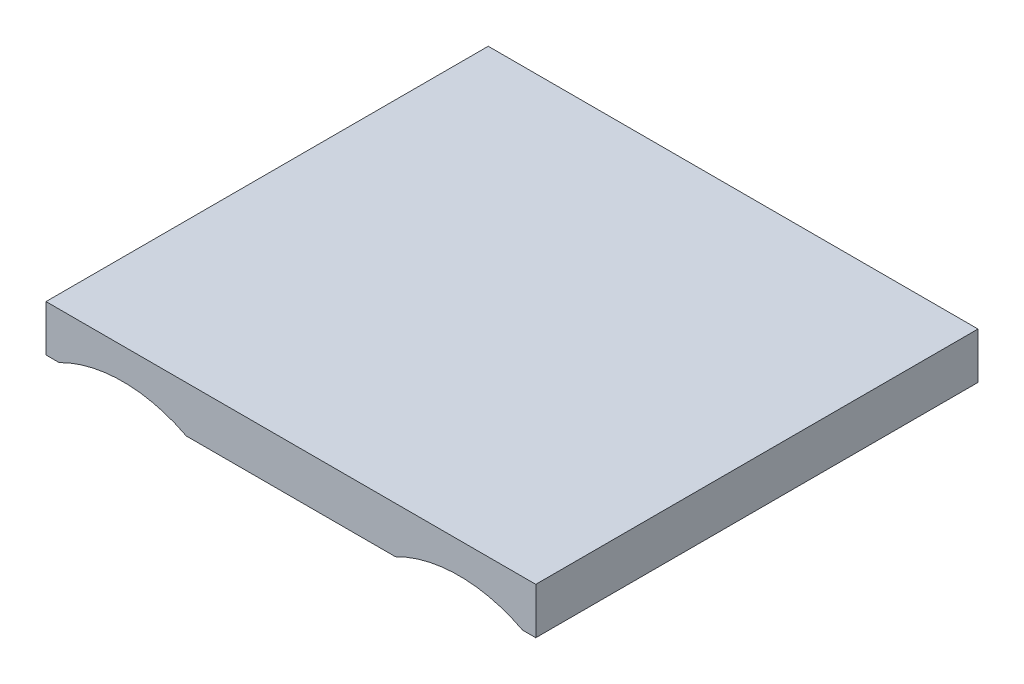
ISO-10303-21;
HEADER;
FILE_DESCRIPTION(('STEP AP214'),'2;1');
FILE_NAME('part.step','',(''),(''),'','','');
FILE_SCHEMA(('AUTOMOTIVE_DESIGN { 1 0 10303 214 1 1 1 1 }'));
ENDSEC;
DATA;
#1=APPLICATION_CONTEXT('core data for automotive mechanical design processes');
#2=APPLICATION_PROTOCOL_DEFINITION('international standard','automotive_design',2000,#1);
#3=PRODUCT_CONTEXT('',#1,'mechanical');
#4=PRODUCT('Part','Part','',(#3));
#5=PRODUCT_RELATED_PRODUCT_CATEGORY('part','',(#4));
#6=PRODUCT_DEFINITION_FORMATION('','',#4);
#7=PRODUCT_DEFINITION_CONTEXT('part definition',#1,'design');
#8=PRODUCT_DEFINITION('design','',#6,#7);
#9=PRODUCT_DEFINITION_SHAPE('','',#8);
#10=(LENGTH_UNIT() NAMED_UNIT(*) SI_UNIT(.MILLI.,.METRE.));
#11=(NAMED_UNIT(*) PLANE_ANGLE_UNIT() SI_UNIT($,.RADIAN.));
#12=(NAMED_UNIT(*) SI_UNIT($,.STERADIAN.) SOLID_ANGLE_UNIT());
#13=UNCERTAINTY_MEASURE_WITH_UNIT(LENGTH_MEASURE(1.E-05),#10,'distance_accuracy_value','');
#14=(GEOMETRIC_REPRESENTATION_CONTEXT(3) GLOBAL_UNCERTAINTY_ASSIGNED_CONTEXT((#13)) GLOBAL_UNIT_ASSIGNED_CONTEXT((#10,
#11,#12)) REPRESENTATION_CONTEXT('',''));
#15=CARTESIAN_POINT('',(0.,0.,0.));
#16=DIRECTION('',(0.,0.,1.));
#17=DIRECTION('',(1.,0.,0.));
#18=AXIS2_PLACEMENT_3D('',#15,#16,#17);
#19=CARTESIAN_POINT('',(-15.875,-1.5,28.668));
#20=DIRECTION('',(-1.,0.,0.));
#21=DIRECTION('',(0.,0.,1.));
#22=AXIS2_PLACEMENT_3D('',#19,#20,#21);
#23=PLANE('',#22);
#24=DIRECTION('',(0.,1.,0.));
#25=VECTOR('',#24,1.);
#26=CARTESIAN_POINT('',(-15.875,-1.5,0.));
#27=LINE('',#26,#25);
#28=CARTESIAN_POINT('',(-15.875,-1.5,0.));
#29=VERTEX_POINT('',#28);
#30=CARTESIAN_POINT('',(-15.875,1.5,0.));
#31=VERTEX_POINT('',#30);
#32=EDGE_CURVE('E128',#29,#31,#27,.T.);
#33=ORIENTED_EDGE('',*,*,#32,.F.);
#34=DIRECTION('',(0.,0.,-1.));
#35=VECTOR('',#34,1.);
#36=CARTESIAN_POINT('',(-15.875,-1.5,28.668));
#37=LINE('',#36,#35);
#38=CARTESIAN_POINT('',(-15.875,-1.5,28.668));
#39=VERTEX_POINT('',#38);
#40=EDGE_CURVE('E11',#39,#29,#37,.T.);
#41=ORIENTED_EDGE('',*,*,#40,.F.);
#42=DIRECTION('',(0.,1.,0.));
#43=VECTOR('',#42,1.);
#44=CARTESIAN_POINT('',(-15.875,-1.5,28.668));
#45=LINE('',#44,#43);
#46=CARTESIAN_POINT('',(-15.875,1.5,28.668));
#47=VERTEX_POINT('',#46);
#48=EDGE_CURVE('E145',#39,#47,#45,.T.);
#49=ORIENTED_EDGE('',*,*,#48,.T.);
#50=DIRECTION('',(0.,0.,-1.));
#51=VECTOR('',#50,1.);
#52=CARTESIAN_POINT('',(-15.875,1.5,28.668));
#53=LINE('',#52,#51);
#54=EDGE_CURVE('E36',#47,#31,#53,.T.);
#55=ORIENTED_EDGE('',*,*,#54,.T.);
#56=EDGE_LOOP('',(#33,#41,#49,#55));
#57=FACE_BOUND('',#56,.T.);
#58=ADVANCED_FACE('F33',(#57),#23,.T.);
#59=CARTESIAN_POINT('',(-15.875,-1.5,28.668));
#60=DIRECTION('',(0.,1.,0.));
#61=DIRECTION('',(-1.,0.,0.));
#62=AXIS2_PLACEMENT_3D('',#59,#60,#61);
#63=PLANE('',#62);
#64=DIRECTION('',(1.,0.,0.));
#65=VECTOR('',#64,1.);
#66=CARTESIAN_POINT('',(-15.875,-1.5,0.));
#67=LINE('',#66,#65);
#68=CARTESIAN_POINT('',(-15.0231056256177,-1.5,0.));
#69=VERTEX_POINT('',#68);
#70=EDGE_CURVE('E144',#29,#69,#67,.T.);
#71=ORIENTED_EDGE('',*,*,#70,.T.);
#72=DIRECTION('',(0.,0.,-1.));
#73=VECTOR('',#72,1.);
#74=CARTESIAN_POINT('',(-15.0231056256177,-1.5,28.668));
#75=LINE('',#74,#73);
#76=CARTESIAN_POINT('',(-15.0231056256177,-1.5,28.668));
#77=VERTEX_POINT('',#76);
#78=EDGE_CURVE('E42',#77,#69,#75,.T.);
#79=ORIENTED_EDGE('',*,*,#78,.F.);
#80=DIRECTION('',(1.,0.,0.));
#81=VECTOR('',#80,1.);
#82=CARTESIAN_POINT('',(-15.875,-1.5,28.668));
#83=LINE('',#82,#81);
#84=EDGE_CURVE('E123',#39,#77,#83,.T.);
#85=ORIENTED_EDGE('',*,*,#84,.F.);
#86=ORIENTED_EDGE('',*,*,#40,.T.);
#87=EDGE_LOOP('',(#71,#79,#85,#86));
#88=FACE_BOUND('',#87,.T.);
#89=ADVANCED_FACE('F160',(#88),#63,.F.);
#90=CARTESIAN_POINT('',(-10.9,-9.5,28.668));
#91=DIRECTION('',(0.,0.,-1.));
#92=DIRECTION('',(-1.,0.,0.));
#93=AXIS2_PLACEMENT_3D('',#90,#91,#92);
#94=CYLINDRICAL_SURFACE('',#93,9.);
#95=CARTESIAN_POINT('',(-10.9,-9.5,0.));
#96=DIRECTION('',(0.,0.,1.));
#97=DIRECTION('',(1.,0.,0.));
#98=AXIS2_PLACEMENT_3D('',#95,#96,#97);
#99=CIRCLE('',#98,9.);
#100=CARTESIAN_POINT('',(-6.77689437438234,-1.5,0.));
#101=VERTEX_POINT('',#100);
#102=EDGE_CURVE('E108',#101,#69,#99,.T.);
#103=ORIENTED_EDGE('',*,*,#102,.F.);
#104=DIRECTION('',(0.,0.,-1.));
#105=VECTOR('',#104,1.);
#106=CARTESIAN_POINT('',(-6.77689437438234,-1.5,28.668));
#107=LINE('',#106,#105);
#108=CARTESIAN_POINT('',(-6.77689437438234,-1.5,28.668));
#109=VERTEX_POINT('',#108);
#110=EDGE_CURVE('E102',#109,#101,#107,.T.);
#111=ORIENTED_EDGE('',*,*,#110,.F.);
#112=CARTESIAN_POINT('',(-10.9,-9.5,28.668));
#113=DIRECTION('',(0.,0.,1.));
#114=DIRECTION('',(1.,0.,0.));
#115=AXIS2_PLACEMENT_3D('',#112,#113,#114);
#116=CIRCLE('',#115,9.);
#117=EDGE_CURVE('E106',#109,#77,#116,.T.);
#118=ORIENTED_EDGE('',*,*,#117,.T.);
#119=ORIENTED_EDGE('',*,*,#78,.T.);
#120=EDGE_LOOP('',(#103,#111,#118,#119));
#121=FACE_BOUND('',#120,.T.);
#122=ADVANCED_FACE('F104',(#121),#94,.F.);
#123=CARTESIAN_POINT('',(-6.77689437438234,-1.5,28.668));
#124=DIRECTION('',(0.,1.,0.));
#125=DIRECTION('',(-1.,0.,0.));
#126=AXIS2_PLACEMENT_3D('',#123,#124,#125);
#127=PLANE('',#126);
#128=DIRECTION('',(1.,0.,0.));
#129=VECTOR('',#128,1.);
#130=CARTESIAN_POINT('',(-6.77689437438234,-1.5,0.));
#131=LINE('',#130,#129);
#132=CARTESIAN_POINT('',(6.77689437438234,-1.5,0.));
#133=VERTEX_POINT('',#132);
#134=EDGE_CURVE('E141',#101,#133,#131,.T.);
#135=ORIENTED_EDGE('',*,*,#134,.T.);
#136=DIRECTION('',(0.,0.,-1.));
#137=VECTOR('',#136,1.);
#138=CARTESIAN_POINT('',(6.77689437438234,-1.5,28.668));
#139=LINE('',#138,#137);
#140=CARTESIAN_POINT('',(6.77689437438234,-1.5,28.668));
#141=VERTEX_POINT('',#140);
#142=EDGE_CURVE('E111',#141,#133,#139,.T.);
#143=ORIENTED_EDGE('',*,*,#142,.F.);
#144=DIRECTION('',(1.,0.,0.));
#145=VECTOR('',#144,1.);
#146=CARTESIAN_POINT('',(-6.77689437438234,-1.5,28.668));
#147=LINE('',#146,#145);
#148=EDGE_CURVE('E114',#109,#141,#147,.T.);
#149=ORIENTED_EDGE('',*,*,#148,.F.);
#150=ORIENTED_EDGE('',*,*,#110,.T.);
#151=EDGE_LOOP('',(#135,#143,#149,#150));
#152=FACE_BOUND('',#151,.T.);
#153=ADVANCED_FACE('F115',(#152),#127,.F.);
#154=CARTESIAN_POINT('',(10.9,-9.5,28.668));
#155=DIRECTION('',(0.,0.,-1.));
#156=DIRECTION('',(-1.,0.,0.));
#157=AXIS2_PLACEMENT_3D('',#154,#155,#156);
#158=CYLINDRICAL_SURFACE('',#157,9.);
#159=CARTESIAN_POINT('',(10.9,-9.5,0.));
#160=DIRECTION('',(0.,0.,-1.));
#161=DIRECTION('',(-1.,0.,0.));
#162=AXIS2_PLACEMENT_3D('',#159,#160,#161);
#163=CIRCLE('',#162,9.);
#164=CARTESIAN_POINT('',(15.0231056256177,-1.5,0.));
#165=VERTEX_POINT('',#164);
#166=EDGE_CURVE('E139',#133,#165,#163,.T.);
#167=ORIENTED_EDGE('',*,*,#166,.T.);
#168=DIRECTION('',(0.,0.,-1.));
#169=VECTOR('',#168,1.);
#170=CARTESIAN_POINT('',(15.0231056256177,-1.5,28.668));
#171=LINE('',#170,#169);
#172=CARTESIAN_POINT('',(15.0231056256177,-1.5,28.668));
#173=VERTEX_POINT('',#172);
#174=EDGE_CURVE('E149',#173,#165,#171,.T.);
#175=ORIENTED_EDGE('',*,*,#174,.F.);
#176=CARTESIAN_POINT('',(10.9,-9.5,28.668));
#177=DIRECTION('',(0.,0.,-1.));
#178=DIRECTION('',(-1.,0.,0.));
#179=AXIS2_PLACEMENT_3D('',#176,#177,#178);
#180=CIRCLE('',#179,9.);
#181=EDGE_CURVE('E119',#141,#173,#180,.T.);
#182=ORIENTED_EDGE('',*,*,#181,.F.);
#183=ORIENTED_EDGE('',*,*,#142,.T.);
#184=EDGE_LOOP('',(#167,#175,#182,#183));
#185=FACE_BOUND('',#184,.T.);
#186=ADVANCED_FACE('F172',(#185),#158,.F.);
#187=CARTESIAN_POINT('',(15.0231056256177,-1.5,28.668));
#188=DIRECTION('',(0.,1.,0.));
#189=DIRECTION('',(-1.,0.,0.));
#190=AXIS2_PLACEMENT_3D('',#187,#188,#189);
#191=PLANE('',#190);
#192=DIRECTION('',(1.,0.,0.));
#193=VECTOR('',#192,1.);
#194=CARTESIAN_POINT('',(15.0231056256177,-1.5,0.));
#195=LINE('',#194,#193);
#196=CARTESIAN_POINT('',(15.875,-1.5,0.));
#197=VERTEX_POINT('',#196);
#198=EDGE_CURVE('E137',#165,#197,#195,.T.);
#199=ORIENTED_EDGE('',*,*,#198,.T.);
#200=DIRECTION('',(0.,0.,-1.));
#201=VECTOR('',#200,1.);
#202=CARTESIAN_POINT('',(15.875,-1.5,28.668));
#203=LINE('',#202,#201);
#204=CARTESIAN_POINT('',(15.875,-1.5,28.668));
#205=VERTEX_POINT('',#204);
#206=EDGE_CURVE('E152',#205,#197,#203,.T.);
#207=ORIENTED_EDGE('',*,*,#206,.F.);
#208=DIRECTION('',(1.,0.,0.));
#209=VECTOR('',#208,1.);
#210=CARTESIAN_POINT('',(15.0231056256177,-1.5,28.668));
#211=LINE('',#210,#209);
#212=EDGE_CURVE('E167',#173,#205,#211,.T.);
#213=ORIENTED_EDGE('',*,*,#212,.F.);
#214=ORIENTED_EDGE('',*,*,#174,.T.);
#215=EDGE_LOOP('',(#199,#207,#213,#214));
#216=FACE_BOUND('',#215,.T.);
#217=ADVANCED_FACE('F176',(#216),#191,.F.);
#218=CARTESIAN_POINT('',(15.875,-1.5,28.668));
#219=DIRECTION('',(-1.,0.,0.));
#220=DIRECTION('',(0.,0.,1.));
#221=AXIS2_PLACEMENT_3D('',#218,#219,#220);
#222=PLANE('',#221);
#223=DIRECTION('',(0.,1.,0.));
#224=VECTOR('',#223,1.);
#225=CARTESIAN_POINT('',(15.875,-1.5,0.));
#226=LINE('',#225,#224);
#227=CARTESIAN_POINT('',(15.875,1.5,0.));
#228=VERTEX_POINT('',#227);
#229=EDGE_CURVE('E134',#197,#228,#226,.T.);
#230=ORIENTED_EDGE('',*,*,#229,.T.);
#231=DIRECTION('',(0.,0.,-1.));
#232=VECTOR('',#231,1.);
#233=CARTESIAN_POINT('',(15.875,1.5,28.668));
#234=LINE('',#233,#232);
#235=CARTESIAN_POINT('',(15.875,1.5,28.668));
#236=VERTEX_POINT('',#235);
#237=EDGE_CURVE('E154',#236,#228,#234,.T.);
#238=ORIENTED_EDGE('',*,*,#237,.F.);
#239=DIRECTION('',(0.,1.,0.));
#240=VECTOR('',#239,1.);
#241=CARTESIAN_POINT('',(15.875,-1.5,28.668));
#242=LINE('',#241,#240);
#243=EDGE_CURVE('E163',#205,#236,#242,.T.);
#244=ORIENTED_EDGE('',*,*,#243,.F.);
#245=ORIENTED_EDGE('',*,*,#206,.T.);
#246=EDGE_LOOP('',(#230,#238,#244,#245));
#247=FACE_BOUND('',#246,.T.);
#248=ADVANCED_FACE('F179',(#247),#222,.F.);
#249=CARTESIAN_POINT('',(-15.875,1.5,28.668));
#250=DIRECTION('',(0.,1.,0.));
#251=DIRECTION('',(0.,0.,1.));
#252=AXIS2_PLACEMENT_3D('',#249,#250,#251);
#253=PLANE('',#252);
#254=DIRECTION('',(1.,0.,0.));
#255=VECTOR('',#254,1.);
#256=CARTESIAN_POINT('',(-15.875,1.5,0.));
#257=LINE('',#256,#255);
#258=EDGE_CURVE('E131',#31,#228,#257,.T.);
#259=ORIENTED_EDGE('',*,*,#258,.F.);
#260=ORIENTED_EDGE('',*,*,#54,.F.);
#261=DIRECTION('',(1.,0.,0.));
#262=VECTOR('',#261,1.);
#263=CARTESIAN_POINT('',(-15.875,1.5,28.668));
#264=LINE('',#263,#262);
#265=EDGE_CURVE('E161',#47,#236,#264,.T.);
#266=ORIENTED_EDGE('',*,*,#265,.T.);
#267=ORIENTED_EDGE('',*,*,#237,.T.);
#268=EDGE_LOOP('',(#259,#260,#266,#267));
#269=FACE_BOUND('',#268,.T.);
#270=ADVANCED_FACE('F156',(#269),#253,.T.);
#271=CARTESIAN_POINT('',(10.9,-9.5,28.668));
#272=DIRECTION('',(0.,0.,-1.));
#273=DIRECTION('',(-1.,0.,0.));
#274=AXIS2_PLACEMENT_3D('',#271,#272,#273);
#275=PLANE('',#274);
#276=ORIENTED_EDGE('',*,*,#48,.F.);
#277=ORIENTED_EDGE('',*,*,#84,.T.);
#278=ORIENTED_EDGE('',*,*,#117,.F.);
#279=ORIENTED_EDGE('',*,*,#148,.T.);
#280=ORIENTED_EDGE('',*,*,#181,.T.);
#281=ORIENTED_EDGE('',*,*,#212,.T.);
#282=ORIENTED_EDGE('',*,*,#243,.T.);
#283=ORIENTED_EDGE('',*,*,#265,.F.);
#284=EDGE_LOOP('',(#276,#277,#278,#279,#280,#281,#282,#283));
#285=FACE_BOUND('',#284,.T.);
#286=ADVANCED_FACE('F122',(#285),#275,.F.);
#287=CARTESIAN_POINT('',(10.9,-9.5,0.));
#288=DIRECTION('',(0.,0.,-1.));
#289=DIRECTION('',(-1.,0.,0.));
#290=AXIS2_PLACEMENT_3D('',#287,#288,#289);
#291=PLANE('',#290);
#292=ORIENTED_EDGE('',*,*,#32,.T.);
#293=ORIENTED_EDGE('',*,*,#258,.T.);
#294=ORIENTED_EDGE('',*,*,#229,.F.);
#295=ORIENTED_EDGE('',*,*,#198,.F.);
#296=ORIENTED_EDGE('',*,*,#166,.F.);
#297=ORIENTED_EDGE('',*,*,#134,.F.);
#298=ORIENTED_EDGE('',*,*,#102,.T.);
#299=ORIENTED_EDGE('',*,*,#70,.F.);
#300=EDGE_LOOP('',(#292,#293,#294,#295,#296,#297,#298,#299));
#301=FACE_BOUND('',#300,.T.);
#302=ADVANCED_FACE('F159',(#301),#291,.T.);
#303=CLOSED_SHELL('',(#58,#89,#122,#153,#186,#217,#248,#270,#286,#302));
#304=MANIFOLD_SOLID_BREP('B2',#303);
#305=ADVANCED_BREP_SHAPE_REPRESENTATION('',(#18,#304),#14);
#306=SHAPE_DEFINITION_REPRESENTATION(#9,#305);
ENDSEC;
END-ISO-10303-21;
